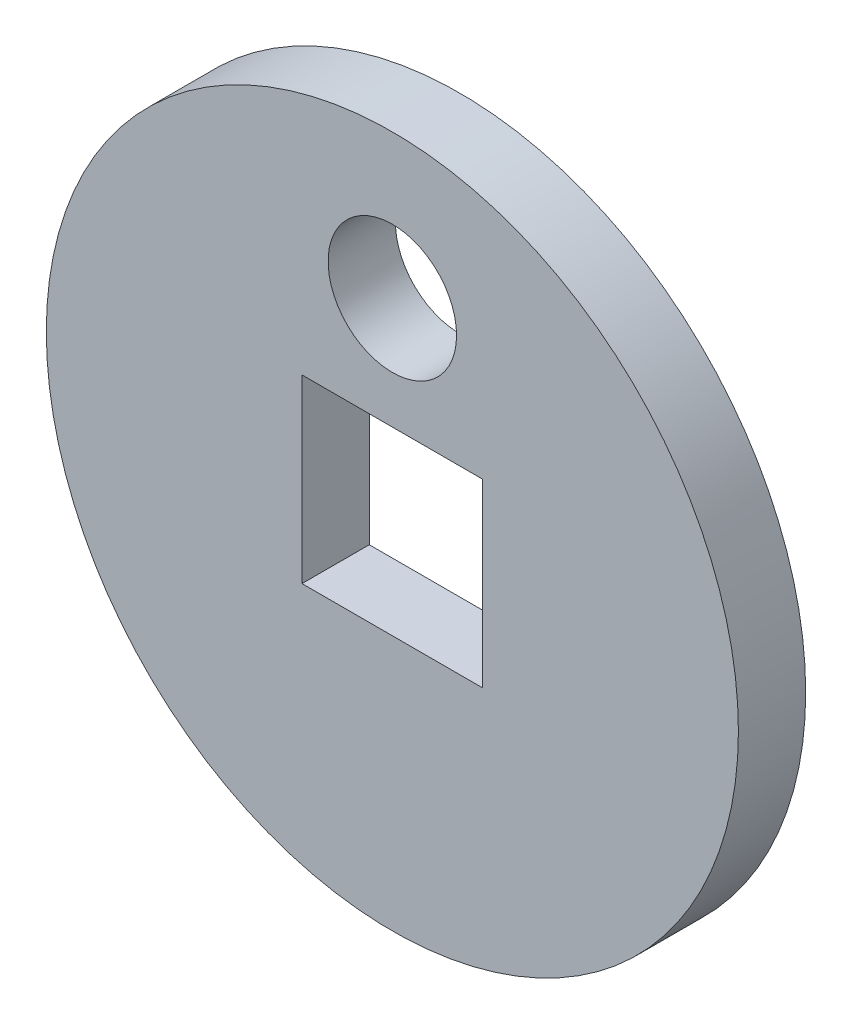
ISO-10303-21;
HEADER;
FILE_DESCRIPTION(('STEP AP214'),'2;1');
FILE_NAME('part.step','',(''),(''),'','','');
FILE_SCHEMA(('AUTOMOTIVE_DESIGN { 1 0 10303 214 1 1 1 1 }'));
ENDSEC;
DATA;
#1=APPLICATION_CONTEXT('core data for automotive mechanical design processes');
#2=APPLICATION_PROTOCOL_DEFINITION('international standard','automotive_design',2000,#1);
#3=PRODUCT_CONTEXT('',#1,'mechanical');
#4=PRODUCT('Part','Part','',(#3));
#5=PRODUCT_RELATED_PRODUCT_CATEGORY('part','',(#4));
#6=PRODUCT_DEFINITION_FORMATION('','',#4);
#7=PRODUCT_DEFINITION_CONTEXT('part definition',#1,'design');
#8=PRODUCT_DEFINITION('design','',#6,#7);
#9=PRODUCT_DEFINITION_SHAPE('','',#8);
#10=(LENGTH_UNIT() NAMED_UNIT(*) SI_UNIT(.MILLI.,.METRE.));
#11=(NAMED_UNIT(*) PLANE_ANGLE_UNIT() SI_UNIT($,.RADIAN.));
#12=(NAMED_UNIT(*) SI_UNIT($,.STERADIAN.) SOLID_ANGLE_UNIT());
#13=UNCERTAINTY_MEASURE_WITH_UNIT(LENGTH_MEASURE(1.E-05),#10,'distance_accuracy_value','');
#14=(GEOMETRIC_REPRESENTATION_CONTEXT(3) GLOBAL_UNCERTAINTY_ASSIGNED_CONTEXT((#13)) GLOBAL_UNIT_ASSIGNED_CONTEXT((#10,
#11,#12)) REPRESENTATION_CONTEXT('',''));
#15=CARTESIAN_POINT('',(0.,0.,0.));
#16=DIRECTION('',(0.,0.,1.));
#17=DIRECTION('',(1.,0.,0.));
#18=AXIS2_PLACEMENT_3D('',#15,#16,#17);
#19=CARTESIAN_POINT('',(0.,0.,1.75));
#20=DIRECTION('',(0.,0.,-1.));
#21=DIRECTION('',(-1.,0.,0.));
#22=AXIS2_PLACEMENT_3D('',#19,#20,#21);
#23=CYLINDRICAL_SURFACE('',#22,9.);
#24=CARTESIAN_POINT('',(0.,0.,1.75));
#25=DIRECTION('',(0.,0.,1.));
#26=DIRECTION('',(1.,0.,0.));
#27=AXIS2_PLACEMENT_3D('',#24,#25,#26);
#28=CIRCLE('',#27,9.);
#29=CARTESIAN_POINT('',(9.,0.,1.75));
#30=VERTEX_POINT('',#29);
#31=EDGE_CURVE('E11',#30,#30,#28,.T.);
#32=ORIENTED_EDGE('',*,*,#31,.F.);
#33=EDGE_LOOP('',(#32));
#34=FACE_BOUND('',#33,.T.);
#35=CARTESIAN_POINT('',(0.,0.,0.));
#36=DIRECTION('',(0.,0.,1.));
#37=DIRECTION('',(1.,0.,0.));
#38=AXIS2_PLACEMENT_3D('',#35,#36,#37);
#39=CIRCLE('',#38,9.);
#40=CARTESIAN_POINT('',(9.,0.,0.));
#41=VERTEX_POINT('',#40);
#42=EDGE_CURVE('E34',#41,#41,#39,.T.);
#43=ORIENTED_EDGE('',*,*,#42,.T.);
#44=EDGE_LOOP('',(#43));
#45=FACE_BOUND('',#44,.T.);
#46=ADVANCED_FACE('F31',(#34,#45),#23,.T.);
#47=CARTESIAN_POINT('',(0.,0.,1.75));
#48=DIRECTION('',(0.,0.,1.));
#49=DIRECTION('',(1.,0.,0.));
#50=AXIS2_PLACEMENT_3D('',#47,#48,#49);
#51=PLANE('',#50);
#52=CARTESIAN_POINT('',(0.,5.25,1.75));
#53=DIRECTION('',(0.,0.,1.));
#54=DIRECTION('',(1.,0.,0.));
#55=AXIS2_PLACEMENT_3D('',#52,#53,#54);
#56=CIRCLE('',#55,1.67);
#57=CARTESIAN_POINT('',(1.67,5.25,1.75));
#58=VERTEX_POINT('',#57);
#59=EDGE_CURVE('E95',#58,#58,#56,.T.);
#60=ORIENTED_EDGE('',*,*,#59,.F.);
#61=EDGE_LOOP('',(#60));
#62=FACE_BOUND('',#61,.T.);
#63=DIRECTION('',(0.,1.,0.));
#64=VECTOR('',#63,1.);
#65=CARTESIAN_POINT('',(2.35,-2.35,1.75));
#66=LINE('',#65,#64);
#67=CARTESIAN_POINT('',(2.35,-2.35,1.75));
#68=VERTEX_POINT('',#67);
#69=CARTESIAN_POINT('',(2.35,2.35,1.75));
#70=VERTEX_POINT('',#69);
#71=EDGE_CURVE('E45',#68,#70,#66,.T.);
#72=ORIENTED_EDGE('',*,*,#71,.F.);
#73=DIRECTION('',(1.,0.,0.));
#74=VECTOR('',#73,1.);
#75=CARTESIAN_POINT('',(-2.35,-2.35,1.75));
#76=LINE('',#75,#74);
#77=CARTESIAN_POINT('',(-2.35,-2.35,1.75));
#78=VERTEX_POINT('',#77);
#79=EDGE_CURVE('E89',#78,#68,#76,.T.);
#80=ORIENTED_EDGE('',*,*,#79,.F.);
#81=DIRECTION('',(0.,-1.,0.));
#82=VECTOR('',#81,1.);
#83=CARTESIAN_POINT('',(-2.35,-2.35,1.75));
#84=LINE('',#83,#82);
#85=CARTESIAN_POINT('',(-2.35,2.35,1.75));
#86=VERTEX_POINT('',#85);
#87=EDGE_CURVE('E92',#86,#78,#84,.T.);
#88=ORIENTED_EDGE('',*,*,#87,.F.);
#89=DIRECTION('',(-1.,0.,0.));
#90=VECTOR('',#89,1.);
#91=CARTESIAN_POINT('',(-2.35,2.35,1.75));
#92=LINE('',#91,#90);
#93=EDGE_CURVE('E101',#70,#86,#92,.T.);
#94=ORIENTED_EDGE('',*,*,#93,.F.);
#95=EDGE_LOOP('',(#72,#80,#88,#94));
#96=FACE_BOUND('',#95,.T.);
#97=ORIENTED_EDGE('',*,*,#31,.T.);
#98=EDGE_LOOP('',(#97));
#99=FACE_BOUND('',#98,.T.);
#100=ADVANCED_FACE('F114',(#62,#96,#99),#51,.T.);
#101=CARTESIAN_POINT('',(0.,0.,0.));
#102=DIRECTION('',(0.,0.,1.));
#103=DIRECTION('',(1.,0.,0.));
#104=AXIS2_PLACEMENT_3D('',#101,#102,#103);
#105=PLANE('',#104);
#106=CARTESIAN_POINT('',(0.,5.25,0.));
#107=DIRECTION('',(0.,0.,1.));
#108=DIRECTION('',(1.,0.,0.));
#109=AXIS2_PLACEMENT_3D('',#106,#107,#108);
#110=CIRCLE('',#109,1.67);
#111=CARTESIAN_POINT('',(1.67,5.25,0.));
#112=VERTEX_POINT('',#111);
#113=EDGE_CURVE('E102',#112,#112,#110,.T.);
#114=ORIENTED_EDGE('',*,*,#113,.T.);
#115=EDGE_LOOP('',(#114));
#116=FACE_BOUND('',#115,.T.);
#117=DIRECTION('',(1.,0.,0.));
#118=VECTOR('',#117,1.);
#119=CARTESIAN_POINT('',(-2.35,-2.35,0.));
#120=LINE('',#119,#118);
#121=CARTESIAN_POINT('',(-2.35,-2.35,0.));
#122=VERTEX_POINT('',#121);
#123=CARTESIAN_POINT('',(2.35,-2.35,0.));
#124=VERTEX_POINT('',#123);
#125=EDGE_CURVE('E79',#122,#124,#120,.T.);
#126=ORIENTED_EDGE('',*,*,#125,.T.);
#127=DIRECTION('',(0.,1.,0.));
#128=VECTOR('',#127,1.);
#129=CARTESIAN_POINT('',(2.35,-2.35,0.));
#130=LINE('',#129,#128);
#131=CARTESIAN_POINT('',(2.35,2.35,0.));
#132=VERTEX_POINT('',#131);
#133=EDGE_CURVE('E73',#124,#132,#130,.T.);
#134=ORIENTED_EDGE('',*,*,#133,.T.);
#135=DIRECTION('',(-1.,0.,0.));
#136=VECTOR('',#135,1.);
#137=CARTESIAN_POINT('',(-2.35,2.35,0.));
#138=LINE('',#137,#136);
#139=CARTESIAN_POINT('',(-2.35,2.35,0.));
#140=VERTEX_POINT('',#139);
#141=EDGE_CURVE('E82',#132,#140,#138,.T.);
#142=ORIENTED_EDGE('',*,*,#141,.T.);
#143=DIRECTION('',(0.,-1.,0.));
#144=VECTOR('',#143,1.);
#145=CARTESIAN_POINT('',(-2.35,-2.35,0.));
#146=LINE('',#145,#144);
#147=EDGE_CURVE('E53',#140,#122,#146,.T.);
#148=ORIENTED_EDGE('',*,*,#147,.T.);
#149=EDGE_LOOP('',(#126,#134,#142,#148));
#150=FACE_BOUND('',#149,.T.);
#151=ORIENTED_EDGE('',*,*,#42,.F.);
#152=EDGE_LOOP('',(#151));
#153=FACE_BOUND('',#152,.T.);
#154=ADVANCED_FACE('F86',(#116,#150,#153),#105,.F.);
#155=CARTESIAN_POINT('',(2.35,-2.35,0.));
#156=DIRECTION('',(1.,0.,0.));
#157=DIRECTION('',(0.,0.,-1.));
#158=AXIS2_PLACEMENT_3D('',#155,#156,#157);
#159=PLANE('',#158);
#160=ORIENTED_EDGE('',*,*,#71,.T.);
#161=DIRECTION('',(0.,0.,1.));
#162=VECTOR('',#161,1.);
#163=CARTESIAN_POINT('',(2.35,2.35,0.));
#164=LINE('',#163,#162);
#165=EDGE_CURVE('E69',#132,#70,#164,.T.);
#166=ORIENTED_EDGE('',*,*,#165,.F.);
#167=ORIENTED_EDGE('',*,*,#133,.F.);
#168=DIRECTION('',(0.,0.,1.));
#169=VECTOR('',#168,1.);
#170=CARTESIAN_POINT('',(2.35,-2.35,0.));
#171=LINE('',#170,#169);
#172=EDGE_CURVE('E106',#124,#68,#171,.T.);
#173=ORIENTED_EDGE('',*,*,#172,.T.);
#174=EDGE_LOOP('',(#160,#166,#167,#173));
#175=FACE_BOUND('',#174,.T.);
#176=ADVANCED_FACE('F71',(#175),#159,.F.);
#177=CARTESIAN_POINT('',(-2.35,-2.35,0.));
#178=DIRECTION('',(0.,-1.,0.));
#179=DIRECTION('',(0.,0.,-1.));
#180=AXIS2_PLACEMENT_3D('',#177,#178,#179);
#181=PLANE('',#180);
#182=ORIENTED_EDGE('',*,*,#79,.T.);
#183=ORIENTED_EDGE('',*,*,#172,.F.);
#184=ORIENTED_EDGE('',*,*,#125,.F.);
#185=DIRECTION('',(0.,0.,1.));
#186=VECTOR('',#185,1.);
#187=CARTESIAN_POINT('',(-2.35,-2.35,0.));
#188=LINE('',#187,#186);
#189=EDGE_CURVE('E108',#122,#78,#188,.T.);
#190=ORIENTED_EDGE('',*,*,#189,.T.);
#191=EDGE_LOOP('',(#182,#183,#184,#190));
#192=FACE_BOUND('',#191,.T.);
#193=ADVANCED_FACE('F117',(#192),#181,.F.);
#194=CARTESIAN_POINT('',(-2.35,-2.35,0.));
#195=DIRECTION('',(-1.,0.,0.));
#196=DIRECTION('',(0.,0.,1.));
#197=AXIS2_PLACEMENT_3D('',#194,#195,#196);
#198=PLANE('',#197);
#199=ORIENTED_EDGE('',*,*,#87,.T.);
#200=ORIENTED_EDGE('',*,*,#189,.F.);
#201=ORIENTED_EDGE('',*,*,#147,.F.);
#202=DIRECTION('',(0.,0.,1.));
#203=VECTOR('',#202,1.);
#204=CARTESIAN_POINT('',(-2.35,2.35,0.));
#205=LINE('',#204,#203);
#206=EDGE_CURVE('E78',#140,#86,#205,.T.);
#207=ORIENTED_EDGE('',*,*,#206,.T.);
#208=EDGE_LOOP('',(#199,#200,#201,#207));
#209=FACE_BOUND('',#208,.T.);
#210=ADVANCED_FACE('F110',(#209),#198,.F.);
#211=CARTESIAN_POINT('',(-2.35,2.35,0.));
#212=DIRECTION('',(0.,1.,0.));
#213=DIRECTION('',(0.,0.,1.));
#214=AXIS2_PLACEMENT_3D('',#211,#212,#213);
#215=PLANE('',#214);
#216=ORIENTED_EDGE('',*,*,#93,.T.);
#217=ORIENTED_EDGE('',*,*,#206,.F.);
#218=ORIENTED_EDGE('',*,*,#141,.F.);
#219=ORIENTED_EDGE('',*,*,#165,.T.);
#220=EDGE_LOOP('',(#216,#217,#218,#219));
#221=FACE_BOUND('',#220,.T.);
#222=ADVANCED_FACE('F83',(#221),#215,.F.);
#223=CARTESIAN_POINT('',(0.,5.25,0.));
#224=DIRECTION('',(0.,0.,1.));
#225=DIRECTION('',(1.,0.,0.));
#226=AXIS2_PLACEMENT_3D('',#223,#224,#225);
#227=CYLINDRICAL_SURFACE('',#226,1.67);
#228=ORIENTED_EDGE('',*,*,#113,.F.);
#229=EDGE_LOOP('',(#228));
#230=FACE_BOUND('',#229,.T.);
#231=ORIENTED_EDGE('',*,*,#59,.T.);
#232=EDGE_LOOP('',(#231));
#233=FACE_BOUND('',#232,.T.);
#234=ADVANCED_FACE('F145',(#230,#233),#227,.F.);
#235=CLOSED_SHELL('',(#46,#100,#154,#176,#193,#210,#222,#234));
#236=MANIFOLD_SOLID_BREP('B2',#235);
#237=ADVANCED_BREP_SHAPE_REPRESENTATION('',(#18,#236),#14);
#238=SHAPE_DEFINITION_REPRESENTATION(#9,#237);
ENDSEC;
END-ISO-10303-21;
